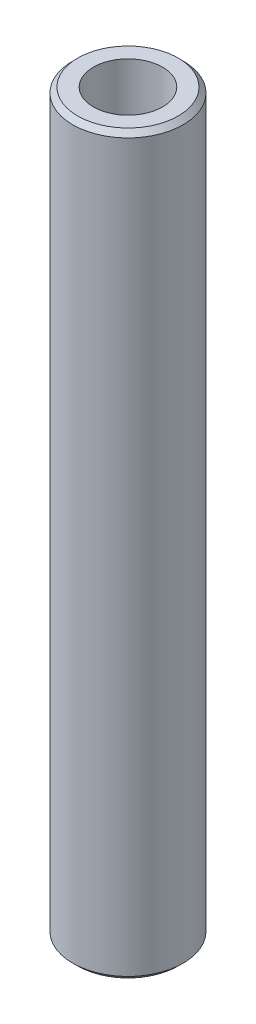
ISO-10303-21;
HEADER;
FILE_DESCRIPTION(('STEP AP214'),'2;1');
FILE_NAME('part.step','',(''),(''),'','','');
FILE_SCHEMA(('AUTOMOTIVE_DESIGN { 1 0 10303 214 1 1 1 1 }'));
ENDSEC;
DATA;
#1=APPLICATION_CONTEXT('core data for automotive mechanical design processes');
#2=APPLICATION_PROTOCOL_DEFINITION('international standard','automotive_design',2000,#1);
#3=PRODUCT_CONTEXT('',#1,'mechanical');
#4=PRODUCT('Part','Part','',(#3));
#5=PRODUCT_RELATED_PRODUCT_CATEGORY('part','',(#4));
#6=PRODUCT_DEFINITION_FORMATION('','',#4);
#7=PRODUCT_DEFINITION_CONTEXT('part definition',#1,'design');
#8=PRODUCT_DEFINITION('design','',#6,#7);
#9=PRODUCT_DEFINITION_SHAPE('','',#8);
#10=(LENGTH_UNIT() NAMED_UNIT(*) SI_UNIT(.MILLI.,.METRE.));
#11=(NAMED_UNIT(*) PLANE_ANGLE_UNIT() SI_UNIT($,.RADIAN.));
#12=(NAMED_UNIT(*) SI_UNIT($,.STERADIAN.) SOLID_ANGLE_UNIT());
#13=UNCERTAINTY_MEASURE_WITH_UNIT(LENGTH_MEASURE(1.E-05),#10,'distance_accuracy_value','');
#14=(GEOMETRIC_REPRESENTATION_CONTEXT(3) GLOBAL_UNCERTAINTY_ASSIGNED_CONTEXT((#13)) GLOBAL_UNIT_ASSIGNED_CONTEXT((#10,
#11,#12)) REPRESENTATION_CONTEXT('',''));
#15=CARTESIAN_POINT('',(0.,0.,0.));
#16=DIRECTION('',(0.,0.,1.));
#17=DIRECTION('',(1.,0.,0.));
#18=AXIS2_PLACEMENT_3D('',#15,#16,#17);
#19=CARTESIAN_POINT('',(0.,600.,0.));
#20=DIRECTION('',(0.,-1.,0.));
#21=DIRECTION('',(0.,0.,-1.));
#22=AXIS2_PLACEMENT_3D('',#19,#20,#21);
#23=CYLINDRICAL_SURFACE('',#22,45.);
#24=CARTESIAN_POINT('',(0.,595.863726080586,0.));
#25=DIRECTION('',(0.,1.,0.));
#26=DIRECTION('',(0.,0.,1.));
#27=AXIS2_PLACEMENT_3D('',#24,#25,#26);
#28=CIRCLE('',#27,45.);
#29=CARTESIAN_POINT('',(0.,595.863726080586,45.));
#30=VERTEX_POINT('',#29);
#31=EDGE_CURVE('E50',#30,#30,#28,.F.);
#32=ORIENTED_EDGE('',*,*,#31,.T.);
#33=EDGE_LOOP('',(#32));
#34=FACE_BOUND('',#33,.T.);
#35=CARTESIAN_POINT('',(0.,4.04984221123683,0.));
#36=DIRECTION('',(0.,1.,0.));
#37=DIRECTION('',(0.,0.,1.));
#38=AXIS2_PLACEMENT_3D('',#35,#36,#37);
#39=CIRCLE('',#38,45.);
#40=CARTESIAN_POINT('',(0.,4.04984221123683,45.));
#41=VERTEX_POINT('',#40);
#42=EDGE_CURVE('E51',#41,#41,#39,.T.);
#43=ORIENTED_EDGE('',*,*,#42,.T.);
#44=EDGE_LOOP('',(#43));
#45=FACE_BOUND('',#44,.T.);
#46=ADVANCED_FACE('F39',(#34,#45),#23,.T.);
#47=CARTESIAN_POINT('',(0.,600.,0.));
#48=DIRECTION('',(0.,1.,0.));
#49=DIRECTION('',(0.,0.,1.));
#50=AXIS2_PLACEMENT_3D('',#47,#48,#49);
#51=PLANE('',#50);
#52=CARTESIAN_POINT('',(0.,600.,0.));
#53=DIRECTION('',(0.,1.,0.));
#54=DIRECTION('',(0.,0.,1.));
#55=AXIS2_PLACEMENT_3D('',#52,#53,#54);
#56=CIRCLE('',#55,40.9501577887629);
#57=CARTESIAN_POINT('',(0.,600.,40.9501577887629));
#58=VERTEX_POINT('',#57);
#59=EDGE_CURVE('E54',#58,#58,#56,.T.);
#60=ORIENTED_EDGE('',*,*,#59,.T.);
#61=EDGE_LOOP('',(#60));
#62=FACE_BOUND('',#61,.T.);
#63=CARTESIAN_POINT('',(0.,600.,0.));
#64=DIRECTION('',(0.,1.,0.));
#65=DIRECTION('',(0.,0.,1.));
#66=AXIS2_PLACEMENT_3D('',#63,#64,#65);
#67=CIRCLE('',#66,28.1488133094836);
#68=CARTESIAN_POINT('',(0.,600.,28.1488133094836));
#69=VERTEX_POINT('',#68);
#70=EDGE_CURVE('E58',#69,#69,#67,.T.);
#71=ORIENTED_EDGE('',*,*,#70,.F.);
#72=EDGE_LOOP('',(#71));
#73=FACE_BOUND('',#72,.T.);
#74=ADVANCED_FACE('F69',(#62,#73),#51,.T.);
#75=CARTESIAN_POINT('',(0.,0.,0.));
#76=DIRECTION('',(0.,1.,0.));
#77=DIRECTION('',(0.,0.,1.));
#78=AXIS2_PLACEMENT_3D('',#75,#76,#77);
#79=PLANE('',#78);
#80=CARTESIAN_POINT('',(0.,0.,0.));
#81=DIRECTION('',(0.,1.,0.));
#82=DIRECTION('',(0.,0.,1.));
#83=AXIS2_PLACEMENT_3D('',#80,#81,#82);
#84=CIRCLE('',#83,40.863726080586);
#85=CARTESIAN_POINT('',(0.,0.,40.863726080586));
#86=VERTEX_POINT('',#85);
#87=EDGE_CURVE('E10',#86,#86,#84,.F.);
#88=ORIENTED_EDGE('',*,*,#87,.T.);
#89=EDGE_LOOP('',(#88));
#90=FACE_BOUND('',#89,.T.);
#91=CARTESIAN_POINT('',(0.,0.,0.));
#92=DIRECTION('',(0.,1.,0.));
#93=DIRECTION('',(0.,0.,1.));
#94=AXIS2_PLACEMENT_3D('',#91,#92,#93);
#95=CIRCLE('',#94,28.1488133094836);
#96=CARTESIAN_POINT('',(0.,0.,28.1488133094836));
#97=VERTEX_POINT('',#96);
#98=EDGE_CURVE('E63',#97,#97,#95,.T.);
#99=ORIENTED_EDGE('',*,*,#98,.T.);
#100=EDGE_LOOP('',(#99));
#101=FACE_BOUND('',#100,.T.);
#102=ADVANCED_FACE('F75',(#90,#101),#79,.F.);
#103=CARTESIAN_POINT('',(0.,600.,0.));
#104=DIRECTION('',(0.,-1.,0.));
#105=DIRECTION('',(0.,0.,-1.));
#106=AXIS2_PLACEMENT_3D('',#103,#104,#105);
#107=CYLINDRICAL_SURFACE('',#106,28.1488133094836);
#108=ORIENTED_EDGE('',*,*,#70,.T.);
#109=EDGE_LOOP('',(#108));
#110=FACE_BOUND('',#109,.T.);
#111=ORIENTED_EDGE('',*,*,#98,.F.);
#112=EDGE_LOOP('',(#111));
#113=FACE_BOUND('',#112,.T.);
#114=ADVANCED_FACE('F70',(#110,#113),#107,.F.);
#115=CARTESIAN_POINT('',(0.,600.,0.));
#116=DIRECTION('',(0.,-1.,0.));
#117=DIRECTION('',(0.,0.,-1.));
#118=AXIS2_PLACEMENT_3D('',#115,#116,#117);
#119=CONICAL_SURFACE('',#118,40.9501577887629,0.77484022661047);
#120=ORIENTED_EDGE('',*,*,#31,.F.);
#121=EDGE_LOOP('',(#120));
#122=FACE_BOUND('',#121,.T.);
#123=ORIENTED_EDGE('',*,*,#59,.F.);
#124=EDGE_LOOP('',(#123));
#125=FACE_BOUND('',#124,.T.);
#126=ADVANCED_FACE('F81',(#122,#125),#119,.T.);
#127=CARTESIAN_POINT('',(0.,4.04984221123683,0.));
#128=DIRECTION('',(0.,1.,0.));
#129=DIRECTION('',(0.,0.,1.));
#130=AXIS2_PLACEMENT_3D('',#127,#128,#129);
#131=CONICAL_SURFACE('',#130,45.,0.795956100184433);
#132=ORIENTED_EDGE('',*,*,#87,.F.);
#133=EDGE_LOOP('',(#132));
#134=FACE_BOUND('',#133,.T.);
#135=ORIENTED_EDGE('',*,*,#42,.F.);
#136=EDGE_LOOP('',(#135));
#137=FACE_BOUND('',#136,.T.);
#138=ADVANCED_FACE('F45',(#134,#137),#131,.T.);
#139=CLOSED_SHELL('',(#46,#74,#102,#114,#126,#138));
#140=MANIFOLD_SOLID_BREP('B2',#139);
#141=ADVANCED_BREP_SHAPE_REPRESENTATION('',(#18,#140),#14);
#142=SHAPE_DEFINITION_REPRESENTATION(#9,#141);
ENDSEC;
END-ISO-10303-21;
